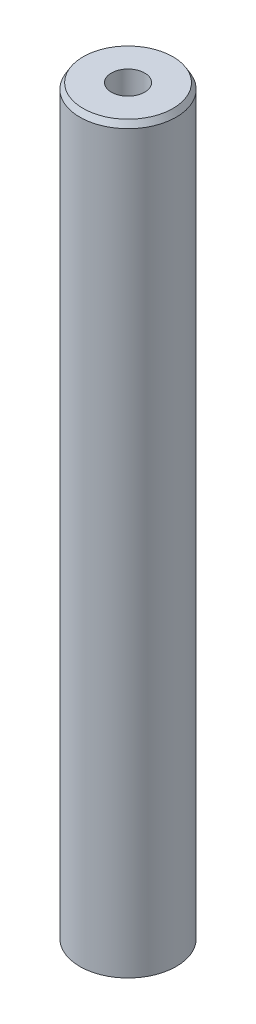
ISO-10303-21;
HEADER;
FILE_DESCRIPTION(('STEP AP214'),'2;1');
FILE_NAME('part.step','',(''),(''),'','','');
FILE_SCHEMA(('AUTOMOTIVE_DESIGN { 1 0 10303 214 1 1 1 1 }'));
ENDSEC;
DATA;
#1=APPLICATION_CONTEXT('core data for automotive mechanical design processes');
#2=APPLICATION_PROTOCOL_DEFINITION('international standard','automotive_design',2000,#1);
#3=PRODUCT_CONTEXT('',#1,'mechanical');
#4=PRODUCT('Part','Part','',(#3));
#5=PRODUCT_RELATED_PRODUCT_CATEGORY('part','',(#4));
#6=PRODUCT_DEFINITION_FORMATION('','',#4);
#7=PRODUCT_DEFINITION_CONTEXT('part definition',#1,'design');
#8=PRODUCT_DEFINITION('design','',#6,#7);
#9=PRODUCT_DEFINITION_SHAPE('','',#8);
#10=(LENGTH_UNIT() NAMED_UNIT(*) SI_UNIT(.MILLI.,.METRE.));
#11=(NAMED_UNIT(*) PLANE_ANGLE_UNIT() SI_UNIT($,.RADIAN.));
#12=(NAMED_UNIT(*) SI_UNIT($,.STERADIAN.) SOLID_ANGLE_UNIT());
#13=UNCERTAINTY_MEASURE_WITH_UNIT(LENGTH_MEASURE(1.E-05),#10,'distance_accuracy_value','');
#14=(GEOMETRIC_REPRESENTATION_CONTEXT(3) GLOBAL_UNCERTAINTY_ASSIGNED_CONTEXT((#13)) GLOBAL_UNIT_ASSIGNED_CONTEXT((#10,
#11,#12)) REPRESENTATION_CONTEXT('',''));
#15=CARTESIAN_POINT('',(0.,0.,0.));
#16=DIRECTION('',(0.,0.,1.));
#17=DIRECTION('',(1.,0.,0.));
#18=AXIS2_PLACEMENT_3D('',#15,#16,#17);
#19=CARTESIAN_POINT('',(0.,231.619543128147,0.));
#20=DIRECTION('',(0.,-1.,0.));
#21=DIRECTION('',(0.,0.,-1.));
#22=AXIS2_PLACEMENT_3D('',#19,#20,#21);
#23=CYLINDRICAL_SURFACE('',#22,15.);
#24=CARTESIAN_POINT('',(0.,229.808383703415,0.));
#25=DIRECTION('',(0.,1.,0.));
#26=DIRECTION('',(0.,0.,1.));
#27=AXIS2_PLACEMENT_3D('',#24,#25,#26);
#28=CIRCLE('',#27,15.);
#29=CARTESIAN_POINT('',(0.,229.808383703415,-15.));
#30=VERTEX_POINT('',#29);
#31=EDGE_CURVE('E50',#30,#30,#28,.F.);
#32=ORIENTED_EDGE('',*,*,#31,.T.);
#33=EDGE_LOOP('',(#32));
#34=FACE_BOUND('',#33,.T.);
#35=CARTESIAN_POINT('',(0.,1.0456733814147,0.));
#36=DIRECTION('',(0.,1.,0.));
#37=DIRECTION('',(0.,0.,1.));
#38=AXIS2_PLACEMENT_3D('',#35,#36,#37);
#39=CIRCLE('',#38,15.);
#40=CARTESIAN_POINT('',(0.,1.0456733814147,15.));
#41=VERTEX_POINT('',#40);
#42=EDGE_CURVE('E51',#41,#41,#39,.T.);
#43=ORIENTED_EDGE('',*,*,#42,.T.);
#44=EDGE_LOOP('',(#43));
#45=FACE_BOUND('',#44,.T.);
#46=ADVANCED_FACE('F39',(#34,#45),#23,.T.);
#47=CARTESIAN_POINT('',(0.,231.619543128147,0.));
#48=DIRECTION('',(0.,1.,0.));
#49=DIRECTION('',(0.,0.,1.));
#50=AXIS2_PLACEMENT_3D('',#47,#48,#49);
#51=PLANE('',#50);
#52=CARTESIAN_POINT('',(0.,231.619543128147,0.));
#53=DIRECTION('',(0.,1.,0.));
#54=DIRECTION('',(0.,0.,1.));
#55=AXIS2_PLACEMENT_3D('',#52,#53,#54);
#56=CIRCLE('',#55,13.9543266185854);
#57=CARTESIAN_POINT('',(0.,231.619543128147,-13.9543266185854));
#58=VERTEX_POINT('',#57);
#59=EDGE_CURVE('E54',#58,#58,#56,.T.);
#60=ORIENTED_EDGE('',*,*,#59,.T.);
#61=EDGE_LOOP('',(#60));
#62=FACE_BOUND('',#61,.T.);
#63=CARTESIAN_POINT('',(0.,231.619543128147,0.));
#64=DIRECTION('',(0.,1.,0.));
#65=DIRECTION('',(0.,0.,1.));
#66=AXIS2_PLACEMENT_3D('',#63,#64,#65);
#67=CIRCLE('',#66,5.1810580454033);
#68=CARTESIAN_POINT('',(0.,231.619543128147,5.1810580454033));
#69=VERTEX_POINT('',#68);
#70=EDGE_CURVE('E58',#69,#69,#67,.T.);
#71=ORIENTED_EDGE('',*,*,#70,.F.);
#72=EDGE_LOOP('',(#71));
#73=FACE_BOUND('',#72,.T.);
#74=ADVANCED_FACE('F69',(#62,#73),#51,.T.);
#75=CARTESIAN_POINT('',(0.,0.,0.));
#76=DIRECTION('',(0.,1.,0.));
#77=DIRECTION('',(0.,0.,1.));
#78=AXIS2_PLACEMENT_3D('',#75,#76,#77);
#79=PLANE('',#78);
#80=CARTESIAN_POINT('',(0.,0.,0.));
#81=DIRECTION('',(0.,1.,0.));
#82=DIRECTION('',(0.,0.,1.));
#83=AXIS2_PLACEMENT_3D('',#80,#81,#82);
#84=CIRCLE('',#83,13.1888405752674);
#85=CARTESIAN_POINT('',(0.,0.,13.1888405752674));
#86=VERTEX_POINT('',#85);
#87=EDGE_CURVE('E10',#86,#86,#84,.F.);
#88=ORIENTED_EDGE('',*,*,#87,.T.);
#89=EDGE_LOOP('',(#88));
#90=FACE_BOUND('',#89,.T.);
#91=CARTESIAN_POINT('',(0.,0.,0.));
#92=DIRECTION('',(0.,1.,0.));
#93=DIRECTION('',(0.,0.,1.));
#94=AXIS2_PLACEMENT_3D('',#91,#92,#93);
#95=CIRCLE('',#94,5.1810580454033);
#96=CARTESIAN_POINT('',(0.,0.,5.1810580454033));
#97=VERTEX_POINT('',#96);
#98=EDGE_CURVE('E63',#97,#97,#95,.T.);
#99=ORIENTED_EDGE('',*,*,#98,.T.);
#100=EDGE_LOOP('',(#99));
#101=FACE_BOUND('',#100,.T.);
#102=ADVANCED_FACE('F75',(#90,#101),#79,.F.);
#103=CARTESIAN_POINT('',(0.,231.619543128147,0.));
#104=DIRECTION('',(0.,-1.,0.));
#105=DIRECTION('',(0.,0.,-1.));
#106=AXIS2_PLACEMENT_3D('',#103,#104,#105);
#107=CYLINDRICAL_SURFACE('',#106,5.1810580454033);
#108=ORIENTED_EDGE('',*,*,#70,.T.);
#109=EDGE_LOOP('',(#108));
#110=FACE_BOUND('',#109,.T.);
#111=ORIENTED_EDGE('',*,*,#98,.F.);
#112=EDGE_LOOP('',(#111));
#113=FACE_BOUND('',#112,.T.);
#114=ADVANCED_FACE('F70',(#110,#113),#107,.F.);
#115=CARTESIAN_POINT('',(0.,231.619543128147,0.));
#116=DIRECTION('',(0.,-1.,0.));
#117=DIRECTION('',(0.,0.,-1.));
#118=AXIS2_PLACEMENT_3D('',#115,#116,#117);
#119=CONICAL_SURFACE('',#118,13.9543266185854,0.523598775598278);
#120=CARTESIAN_POINT('',(0.,229.808383703415,-15.));
#121=CARTESIAN_POINT('',(0.,229.827249947422,-14.9891075689436));
#122=CARTESIAN_POINT('',(0.,229.84611619143,-14.9782151378872));
#123=CARTESIAN_POINT('',(0.,229.883848679445,-14.9564302757744));
#124=CARTESIAN_POINT('',(0.,229.902714923453,-14.945537844718));
#125=CARTESIAN_POINT('',(0.,229.940447411468,-14.9237529826052));
#126=CARTESIAN_POINT('',(0.,229.959313655476,-14.9128605515488));
#127=CARTESIAN_POINT('',(0.,229.997046143491,-14.891075689436));
#128=CARTESIAN_POINT('',(0.,230.015912387499,-14.8801832583796));
#129=CARTESIAN_POINT('',(0.,230.053644875514,-14.8583983962668));
#130=CARTESIAN_POINT('',(0.,230.072511119521,-14.8475059652104));
#131=CARTESIAN_POINT('',(0.,230.110243607537,-14.8257211030976));
#132=CARTESIAN_POINT('',(0.,230.129109851544,-14.8148286720412));
#133=CARTESIAN_POINT('',(0.,230.16684233956,-14.7930438099284));
#134=CARTESIAN_POINT('',(0.,230.185708583567,-14.782151378872));
#135=CARTESIAN_POINT('',(0.,230.223441071582,-14.7603665167592));
#136=CARTESIAN_POINT('',(0.,230.24230731559,-14.7494740857028));
#137=CARTESIAN_POINT('',(0.,230.280039803605,-14.72768922359));
#138=CARTESIAN_POINT('',(0.,230.298906047613,-14.7167967925336));
#139=CARTESIAN_POINT('',(0.,230.336638535628,-14.6950119304207));
#140=CARTESIAN_POINT('',(0.,230.355504779636,-14.6841194993643));
#141=CARTESIAN_POINT('',(0.,230.393237267651,-14.6623346372515));
#142=CARTESIAN_POINT('',(0.,230.412103511659,-14.6514422061951));
#143=CARTESIAN_POINT('',(0.,230.449835999674,-14.6296573440823));
#144=CARTESIAN_POINT('',(0.,230.468702243682,-14.6187649130259));
#145=CARTESIAN_POINT('',(0.,230.506434731697,-14.5969800509131));
#146=CARTESIAN_POINT('',(0.,230.525300975705,-14.5860876198567));
#147=CARTESIAN_POINT('',(0.,230.56303346372,-14.5643027577439));
#148=CARTESIAN_POINT('',(0.,230.581899707727,-14.5534103266875));
#149=CARTESIAN_POINT('',(0.,230.619632195743,-14.5316254645747));
#150=CARTESIAN_POINT('',(0.,230.63849843975,-14.5207330335183));
#151=CARTESIAN_POINT('',(0.,230.676230927766,-14.4989481714055));
#152=CARTESIAN_POINT('',(0.,230.695097171773,-14.4880557403491));
#153=CARTESIAN_POINT('',(0.,230.732829659788,-14.4662708782363));
#154=CARTESIAN_POINT('',(0.,230.751695903796,-14.4553784471799));
#155=CARTESIAN_POINT('',(0.,230.789428391811,-14.4335935850671));
#156=CARTESIAN_POINT('',(0.,230.808294635819,-14.4227011540107));
#157=CARTESIAN_POINT('',(0.,230.846027123834,-14.4009162918979));
#158=CARTESIAN_POINT('',(0.,230.864893367842,-14.3900238608415));
#159=CARTESIAN_POINT('',(0.,230.902625855857,-14.3682389987287));
#160=CARTESIAN_POINT('',(0.,230.921492099865,-14.3573465676723));
#161=CARTESIAN_POINT('',(0.,230.95922458788,-14.3355617055595));
#162=CARTESIAN_POINT('',(0.,230.978090831888,-14.3246692745031));
#163=CARTESIAN_POINT('',(0.,231.015823319903,-14.3028844123903));
#164=CARTESIAN_POINT('',(0.,231.034689563911,-14.2919919813339));
#165=CARTESIAN_POINT('',(0.,231.072422051926,-14.2702071192211));
#166=CARTESIAN_POINT('',(0.,231.091288295933,-14.2593146881647));
#167=CARTESIAN_POINT('',(0.,231.129020783949,-14.2375298260519));
#168=CARTESIAN_POINT('',(0.,231.147887027956,-14.2266373949955));
#169=CARTESIAN_POINT('',(0.,231.185619515972,-14.2048525328827));
#170=CARTESIAN_POINT('',(0.,231.204485759979,-14.1939601018262));
#171=CARTESIAN_POINT('',(0.,231.242218247995,-14.1721752397134));
#172=CARTESIAN_POINT('',(0.,231.261084492002,-14.161282808657));
#173=CARTESIAN_POINT('',(0.,231.298816980017,-14.1394979465442));
#174=CARTESIAN_POINT('',(0.,231.317683224025,-14.1286055154878));
#175=CARTESIAN_POINT('',(0.,231.35541571204,-14.106820653375));
#176=CARTESIAN_POINT('',(0.,231.374281956048,-14.0959282223186));
#177=CARTESIAN_POINT('',(0.,231.412014444063,-14.0741433602058));
#178=CARTESIAN_POINT('',(0.,231.430880688071,-14.0632509291494));
#179=CARTESIAN_POINT('',(0.,231.468613176086,-14.0414660670366));
#180=CARTESIAN_POINT('',(0.,231.487479420094,-14.0305736359802));
#181=CARTESIAN_POINT('',(0.,231.525211908109,-14.0087887738674));
#182=CARTESIAN_POINT('',(0.,231.544078152117,-13.997896342811));
#183=CARTESIAN_POINT('',(0.,231.581810640132,-13.9761114806982));
#184=CARTESIAN_POINT('',(0.,231.60067688414,-13.9652190496418));
#185=CARTESIAN_POINT('',(0.,231.619543128147,-13.9543266185854));
#186=B_SPLINE_CURVE_WITH_KNOTS('',3,(#120,#121,#122,#123,#124,#125,#126,#127,#128,#129,#130,
#131,#132,#133,#134,#135,#136,#137,#138,#139,#140,#141,#142,#143,#144,#145,#146,#147,#148,#149,
#150,#151,#152,#153,#154,#155,#156,#157,#158,#159,#160,#161,#162,#163,#164,#165,#166,#167,#168,
#169,#170,#171,#172,#173,#174,#175,#176,#177,#178,#179,#180,#181,#182,#183,#184,#185),
.UNSPECIFIED.,.F.,.F.,(4,2,2,2,2,2,2,2,2,2,2,2,2,2,2,2,2,2,2,2,2,2,2,2,2,2,2,2,2,2,2,2,4),(0.,
0.0653545863384279,0.130709172676831,0.196063759015258,0.261418345353661,0.326772931692088,
0.392127518030492,0.457482104368919,0.522836690707322,0.588191277045749,0.653545863384153,
0.71890044972258,0.784255036061007,0.84960962239941,0.914964208737813,0.98031879507624,
1.04567338141464,1.11102796775307,1.17638255409147,1.2417371404299,1.3070917267683,
1.37244631310673,1.43780089944514,1.50315548578356,1.56851007212199,1.63386465846039,
1.69921924479882,1.76457383113722,1.82992841747565,1.89528300381405,1.96063759015248,
2.02599217649088,2.09134676282931),.UNSPECIFIED.);
#187=EDGE_CURVE('BSEAM81',#30,#58,#186,.T.);
#188=ORIENTED_EDGE('',*,*,#31,.F.);
#189=ORIENTED_EDGE('',*,*,#59,.F.);
#190=ORIENTED_EDGE('',*,*,#187,.T.);
#191=ORIENTED_EDGE('',*,*,#187,.F.);
#192=EDGE_LOOP('',(#188,#190,#189,#191));
#193=FACE_BOUND('',#192,.T.);
#194=ADVANCED_FACE('F81',(#193),#119,.T.);
#195=CARTESIAN_POINT('',(0.,1.0456733814147,0.));
#196=DIRECTION('',(0.,1.,0.));
#197=DIRECTION('',(0.,0.,1.));
#198=AXIS2_PLACEMENT_3D('',#195,#196,#197);
#199=CONICAL_SURFACE('',#198,15.,1.0471975511966);
#200=ORIENTED_EDGE('',*,*,#87,.F.);
#201=EDGE_LOOP('',(#200));
#202=FACE_BOUND('',#201,.T.);
#203=ORIENTED_EDGE('',*,*,#42,.F.);
#204=EDGE_LOOP('',(#203));
#205=FACE_BOUND('',#204,.T.);
#206=ADVANCED_FACE('F45',(#202,#205),#199,.T.);
#207=CLOSED_SHELL('',(#46,#74,#102,#114,#194,#206));
#208=MANIFOLD_SOLID_BREP('B2',#207);
#209=ADVANCED_BREP_SHAPE_REPRESENTATION('',(#18,#208),#14);
#210=SHAPE_DEFINITION_REPRESENTATION(#9,#209);
ENDSEC;
END-ISO-10303-21;
